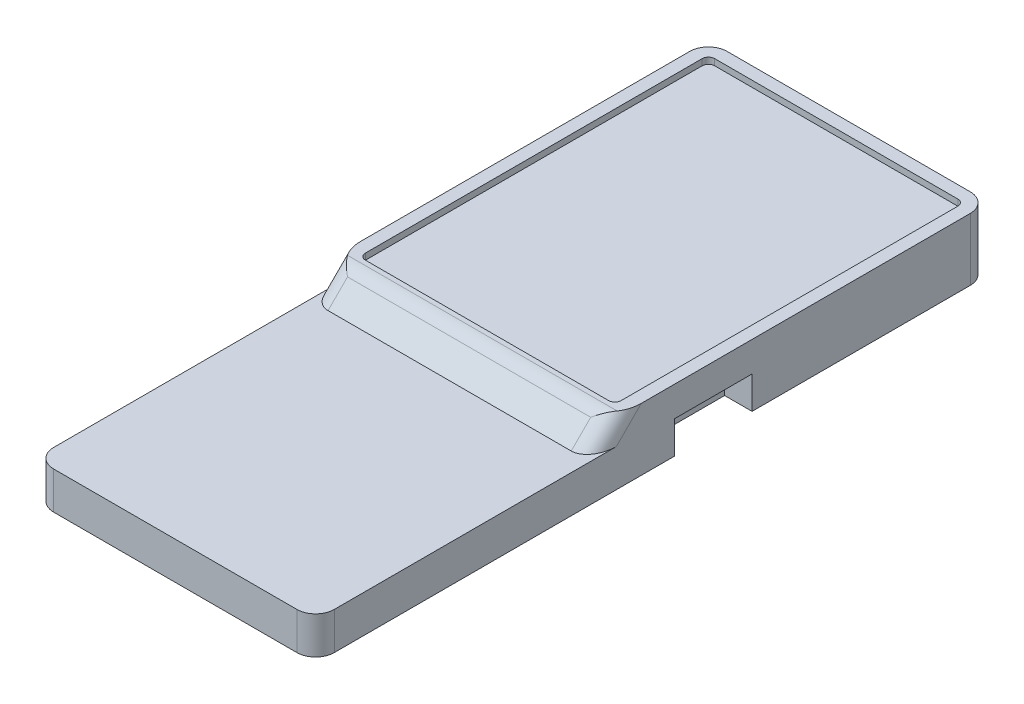
ISO-10303-21;
HEADER;
FILE_DESCRIPTION(('STEP AP214'),'2;1');
FILE_NAME('part.step','',(''),(''),'','','');
FILE_SCHEMA(('AUTOMOTIVE_DESIGN { 1 0 10303 214 1 1 1 1 }'));
ENDSEC;
DATA;
#1=APPLICATION_CONTEXT('core data for automotive mechanical design processes');
#2=APPLICATION_PROTOCOL_DEFINITION('international standard','automotive_design',2000,#1);
#3=PRODUCT_CONTEXT('',#1,'mechanical');
#4=PRODUCT('Part','Part','',(#3));
#5=PRODUCT_RELATED_PRODUCT_CATEGORY('part','',(#4));
#6=PRODUCT_DEFINITION_FORMATION('','',#4);
#7=PRODUCT_DEFINITION_CONTEXT('part definition',#1,'design');
#8=PRODUCT_DEFINITION('design','',#6,#7);
#9=PRODUCT_DEFINITION_SHAPE('','',#8);
#10=(LENGTH_UNIT() NAMED_UNIT(*) SI_UNIT(.MILLI.,.METRE.));
#11=(NAMED_UNIT(*) PLANE_ANGLE_UNIT() SI_UNIT($,.RADIAN.));
#12=(NAMED_UNIT(*) SI_UNIT($,.STERADIAN.) SOLID_ANGLE_UNIT());
#13=UNCERTAINTY_MEASURE_WITH_UNIT(LENGTH_MEASURE(1.E-05),#10,'distance_accuracy_value','');
#14=(GEOMETRIC_REPRESENTATION_CONTEXT(3) GLOBAL_UNCERTAINTY_ASSIGNED_CONTEXT((#13)) GLOBAL_UNIT_ASSIGNED_CONTEXT((#10,
#11,#12)) REPRESENTATION_CONTEXT('',''));
#15=CARTESIAN_POINT('',(0.,0.,0.));
#16=DIRECTION('',(0.,0.,1.));
#17=DIRECTION('',(1.,0.,0.));
#18=AXIS2_PLACEMENT_3D('',#15,#16,#17);
#19=CARTESIAN_POINT('',(-12.4,-4.5,0.));
#20=DIRECTION('',(-1.,0.,0.));
#21=DIRECTION('',(0.,0.,1.));
#22=AXIS2_PLACEMENT_3D('',#19,#20,#21);
#23=PLANE('',#22);
#24=DIRECTION('',(0.,0.,1.));
#25=VECTOR('',#24,1.);
#26=CARTESIAN_POINT('',(-12.4,-1.5,15.));
#27=LINE('',#26,#25);
#28=CARTESIAN_POINT('',(-12.4,-1.5,14.8786796564404));
#29=VERTEX_POINT('',#28);
#30=CARTESIAN_POINT('',(-12.4,-1.5,37.5));
#31=VERTEX_POINT('',#30);
#32=EDGE_CURVE('E386',#29,#31,#27,.T.);
#33=ORIENTED_EDGE('',*,*,#32,.F.);
#34=DIRECTION('',(0.,0.707106781186547,-0.707106781186549));
#35=VECTOR('',#34,1.);
#36=CARTESIAN_POINT('',(-12.4,4.43933982822018,8.93933982822016));
#37=LINE('',#36,#35);
#38=CARTESIAN_POINT('',(-12.4,0.5,12.8786796564404));
#39=VERTEX_POINT('',#38);
#40=EDGE_CURVE('E249',#29,#39,#37,.T.);
#41=ORIENTED_EDGE('',*,*,#40,.T.);
#42=DIRECTION('',(0.,0.,-1.));
#43=VECTOR('',#42,1.);
#44=CARTESIAN_POINT('',(-12.4,0.5,15.));
#45=LINE('',#44,#43);
#46=CARTESIAN_POINT('',(-12.4,0.5,-13.5));
#47=VERTEX_POINT('',#46);
#48=EDGE_CURVE('E468',#39,#47,#45,.T.);
#49=ORIENTED_EDGE('',*,*,#48,.T.);
#50=DIRECTION('',(0.,1.,0.));
#51=VECTOR('',#50,1.);
#52=CARTESIAN_POINT('',(-12.4,-4.5,-13.5));
#53=LINE('',#52,#51);
#54=CARTESIAN_POINT('',(-12.4,-4.5,-13.5));
#55=VERTEX_POINT('',#54);
#56=EDGE_CURVE('E428',#47,#55,#53,.F.);
#57=ORIENTED_EDGE('',*,*,#56,.T.);
#58=DIRECTION('',(0.,0.,1.));
#59=VECTOR('',#58,1.);
#60=CARTESIAN_POINT('',(-12.4,-4.5,0.));
#61=LINE('',#60,#59);
#62=CARTESIAN_POINT('',(-12.4,-4.5,4.));
#63=VERTEX_POINT('',#62);
#64=EDGE_CURVE('E399',#55,#63,#61,.T.);
#65=ORIENTED_EDGE('',*,*,#64,.T.);
#66=DIRECTION('',(0.,-1.,0.));
#67=VECTOR('',#66,1.);
#68=CARTESIAN_POINT('',(-12.4,-1.9,4.));
#69=LINE('',#68,#67);
#70=CARTESIAN_POINT('',(-12.4,-1.9,4.));
#71=VERTEX_POINT('',#70);
#72=EDGE_CURVE('E340',#71,#63,#69,.T.);
#73=ORIENTED_EDGE('',*,*,#72,.F.);
#74=DIRECTION('',(0.,0.,1.));
#75=VECTOR('',#74,1.);
#76=CARTESIAN_POINT('',(-12.4,-1.9,10.2));
#77=LINE('',#76,#75);
#78=CARTESIAN_POINT('',(-12.4,-1.9,10.2));
#79=VERTEX_POINT('',#78);
#80=EDGE_CURVE('E330',#71,#79,#77,.T.);
#81=ORIENTED_EDGE('',*,*,#80,.T.);
#82=DIRECTION('',(0.,-1.,0.));
#83=VECTOR('',#82,1.);
#84=CARTESIAN_POINT('',(-12.4,-1.9,10.2));
#85=LINE('',#84,#83);
#86=CARTESIAN_POINT('',(-12.4,-4.5,10.2));
#87=VERTEX_POINT('',#86);
#88=EDGE_CURVE('E348',#79,#87,#85,.T.);
#89=ORIENTED_EDGE('',*,*,#88,.T.);
#90=CARTESIAN_POINT('',(-12.4,-4.5,37.5));
#91=VERTEX_POINT('',#90);
#92=EDGE_CURVE('E398',#87,#91,#61,.T.);
#93=ORIENTED_EDGE('',*,*,#92,.T.);
#94=DIRECTION('',(0.,-1.,0.));
#95=VECTOR('',#94,1.);
#96=CARTESIAN_POINT('',(-12.4,-1.5,37.5));
#97=LINE('',#96,#95);
#98=EDGE_CURVE('E425',#91,#31,#97,.F.);
#99=ORIENTED_EDGE('',*,*,#98,.T.);
#100=EDGE_LOOP('',(#33,#41,#49,#57,#65,#73,#81,#89,#93,#99));
#101=FACE_BOUND('',#100,.T.);
#102=ADVANCED_FACE('F36',(#101),#23,.T.);
#103=CARTESIAN_POINT('',(0.,-4.5,0.));
#104=DIRECTION('',(0.,1.,0.));
#105=DIRECTION('',(0.,0.,1.));
#106=AXIS2_PLACEMENT_3D('',#103,#104,#105);
#107=PLANE('',#106);
#108=DIRECTION('',(1.,0.,0.));
#109=VECTOR('',#108,1.);
#110=CARTESIAN_POINT('',(-10.2,-4.5,10.2));
#111=LINE('',#110,#109);
#112=CARTESIAN_POINT('',(-10.2,-4.5,10.2));
#113=VERTEX_POINT('',#112);
#114=EDGE_CURVE('E334',#87,#113,#111,.T.);
#115=ORIENTED_EDGE('',*,*,#114,.T.);
#116=DIRECTION('',(0.,0.,-1.));
#117=VECTOR('',#116,1.);
#118=CARTESIAN_POINT('',(-10.2,-4.5,10.2));
#119=LINE('',#118,#117);
#120=CARTESIAN_POINT('',(-10.2,-4.5,4.));
#121=VERTEX_POINT('',#120);
#122=EDGE_CURVE('E343',#113,#121,#119,.T.);
#123=ORIENTED_EDGE('',*,*,#122,.T.);
#124=DIRECTION('',(-1.,0.,0.));
#125=VECTOR('',#124,1.);
#126=CARTESIAN_POINT('',(-10.2,-4.5,4.));
#127=LINE('',#126,#125);
#128=EDGE_CURVE('E329',#121,#63,#127,.T.);
#129=ORIENTED_EDGE('',*,*,#128,.T.);
#130=ORIENTED_EDGE('',*,*,#64,.F.);
#131=CARTESIAN_POINT('',(-10.9,-4.5,-13.5));
#132=DIRECTION('',(0.,1.,0.));
#133=DIRECTION('',(0.,0.,1.));
#134=AXIS2_PLACEMENT_3D('',#131,#132,#133);
#135=CIRCLE('',#134,1.5);
#136=CARTESIAN_POINT('',(-10.9,-4.5,-15.));
#137=VERTEX_POINT('',#136);
#138=EDGE_CURVE('E420',#55,#137,#135,.F.);
#139=ORIENTED_EDGE('',*,*,#138,.T.);
#140=DIRECTION('',(1.,0.,0.));
#141=VECTOR('',#140,1.);
#142=CARTESIAN_POINT('',(0.,-4.5,-15.));
#143=LINE('',#142,#141);
#144=CARTESIAN_POINT('',(8.6,-4.5,-15.));
#145=VERTEX_POINT('',#144);
#146=EDGE_CURVE('E393',#137,#145,#143,.T.);
#147=ORIENTED_EDGE('',*,*,#146,.T.);
#148=CARTESIAN_POINT('',(8.6,-4.5,-13.5));
#149=DIRECTION('',(0.,1.,0.));
#150=DIRECTION('',(0.,0.,1.));
#151=AXIS2_PLACEMENT_3D('',#148,#149,#150);
#152=CIRCLE('',#151,1.5);
#153=CARTESIAN_POINT('',(10.1,-4.5,-13.5));
#154=VERTEX_POINT('',#153);
#155=EDGE_CURVE('E422',#145,#154,#152,.F.);
#156=ORIENTED_EDGE('',*,*,#155,.T.);
#157=DIRECTION('',(0.,0.,-1.));
#158=VECTOR('',#157,1.);
#159=CARTESIAN_POINT('',(10.1,-4.5,0.));
#160=LINE('',#159,#158);
#161=CARTESIAN_POINT('',(10.1,-4.5,4.));
#162=VERTEX_POINT('',#161);
#163=EDGE_CURVE('E402',#162,#154,#160,.T.);
#164=ORIENTED_EDGE('',*,*,#163,.F.);
#165=DIRECTION('',(1.,0.,0.));
#166=VECTOR('',#165,1.);
#167=CARTESIAN_POINT('',(7.9,-4.5,4.));
#168=LINE('',#167,#166);
#169=CARTESIAN_POINT('',(7.9,-4.5,4.));
#170=VERTEX_POINT('',#169);
#171=EDGE_CURVE('E361',#170,#162,#168,.T.);
#172=ORIENTED_EDGE('',*,*,#171,.F.);
#173=DIRECTION('',(0.,0.,-1.));
#174=VECTOR('',#173,1.);
#175=CARTESIAN_POINT('',(7.9,-4.5,10.2));
#176=LINE('',#175,#174);
#177=CARTESIAN_POINT('',(7.9,-4.5,10.2));
#178=VERTEX_POINT('',#177);
#179=EDGE_CURVE('E373',#178,#170,#176,.T.);
#180=ORIENTED_EDGE('',*,*,#179,.F.);
#181=DIRECTION('',(-1.,0.,0.));
#182=VECTOR('',#181,1.);
#183=CARTESIAN_POINT('',(7.9,-4.5,10.2));
#184=LINE('',#183,#182);
#185=CARTESIAN_POINT('',(10.1,-4.5,10.2));
#186=VERTEX_POINT('',#185);
#187=EDGE_CURVE('E351',#186,#178,#184,.T.);
#188=ORIENTED_EDGE('',*,*,#187,.F.);
#189=CARTESIAN_POINT('',(10.1,-4.5,37.5));
#190=VERTEX_POINT('',#189);
#191=EDGE_CURVE('E403',#190,#186,#160,.T.);
#192=ORIENTED_EDGE('',*,*,#191,.F.);
#193=CARTESIAN_POINT('',(8.6,-4.5,37.5));
#194=DIRECTION('',(0.,1.,0.));
#195=DIRECTION('',(0.,0.,1.));
#196=AXIS2_PLACEMENT_3D('',#193,#194,#195);
#197=CIRCLE('',#196,1.5);
#198=CARTESIAN_POINT('',(8.6,-4.5,39.));
#199=VERTEX_POINT('',#198);
#200=EDGE_CURVE('E418',#190,#199,#197,.F.);
#201=ORIENTED_EDGE('',*,*,#200,.T.);
#202=DIRECTION('',(1.,0.,0.));
#203=VECTOR('',#202,1.);
#204=CARTESIAN_POINT('',(-12.4,-4.5,39.));
#205=LINE('',#204,#203);
#206=CARTESIAN_POINT('',(-10.9,-4.5,39.));
#207=VERTEX_POINT('',#206);
#208=EDGE_CURVE('E380',#207,#199,#205,.T.);
#209=ORIENTED_EDGE('',*,*,#208,.F.);
#210=CARTESIAN_POINT('',(-10.9,-4.5,37.5));
#211=DIRECTION('',(0.,1.,0.));
#212=DIRECTION('',(0.,0.,1.));
#213=AXIS2_PLACEMENT_3D('',#210,#211,#212);
#214=CIRCLE('',#213,1.5);
#215=EDGE_CURVE('E415',#207,#91,#214,.F.);
#216=ORIENTED_EDGE('',*,*,#215,.T.);
#217=ORIENTED_EDGE('',*,*,#92,.F.);
#218=EDGE_LOOP('',(#115,#123,#129,#130,#139,#147,#156,#164,#172,#180,#188,#192,#201,#209,#216,#217));
#219=FACE_BOUND('',#218,.T.);
#220=ADVANCED_FACE('F502',(#219),#107,.F.);
#221=CARTESIAN_POINT('',(0.,-4.5,-15.));
#222=DIRECTION('',(0.,0.,1.));
#223=DIRECTION('',(1.,0.,0.));
#224=AXIS2_PLACEMENT_3D('',#221,#222,#223);
#225=PLANE('',#224);
#226=DIRECTION('',(0.,1.,0.));
#227=VECTOR('',#226,1.);
#228=CARTESIAN_POINT('',(-10.9,0.,-15.));
#229=LINE('',#228,#227);
#230=CARTESIAN_POINT('',(-10.9,0.5,-15.));
#231=VERTEX_POINT('',#230);
#232=EDGE_CURVE('E411',#137,#231,#229,.T.);
#233=ORIENTED_EDGE('',*,*,#232,.T.);
#234=DIRECTION('',(1.,0.,0.));
#235=VECTOR('',#234,1.);
#236=CARTESIAN_POINT('',(8.6,0.5,-15.));
#237=LINE('',#236,#235);
#238=CARTESIAN_POINT('',(8.6,0.5,-15.));
#239=VERTEX_POINT('',#238);
#240=EDGE_CURVE('E459',#231,#239,#237,.T.);
#241=ORIENTED_EDGE('',*,*,#240,.T.);
#242=DIRECTION('',(0.,1.,0.));
#243=VECTOR('',#242,1.);
#244=CARTESIAN_POINT('',(8.6,-4.5,-15.));
#245=LINE('',#244,#243);
#246=EDGE_CURVE('E413',#239,#145,#245,.F.);
#247=ORIENTED_EDGE('',*,*,#246,.T.);
#248=ORIENTED_EDGE('',*,*,#146,.F.);
#249=EDGE_LOOP('',(#233,#241,#247,#248));
#250=FACE_BOUND('',#249,.T.);
#251=ADVANCED_FACE('F508',(#250),#225,.F.);
#252=CARTESIAN_POINT('',(10.1,-4.5,0.));
#253=DIRECTION('',(1.,0.,0.));
#254=DIRECTION('',(0.,0.,-1.));
#255=AXIS2_PLACEMENT_3D('',#252,#253,#254);
#256=PLANE('',#255);
#257=DIRECTION('',(0.,0.,1.));
#258=VECTOR('',#257,1.);
#259=CARTESIAN_POINT('',(10.1,0.5,15.));
#260=LINE('',#259,#258);
#261=CARTESIAN_POINT('',(10.1,0.5,-13.5));
#262=VERTEX_POINT('',#261);
#263=CARTESIAN_POINT('',(10.1,0.5,12.8786796564404));
#264=VERTEX_POINT('',#263);
#265=EDGE_CURVE('E453',#262,#264,#260,.T.);
#266=ORIENTED_EDGE('',*,*,#265,.T.);
#267=DIRECTION('',(0.,0.707106781186547,-0.707106781186549));
#268=VECTOR('',#267,1.);
#269=CARTESIAN_POINT('',(10.1,4.43933982822018,8.93933982822016));
#270=LINE('',#269,#268);
#271=CARTESIAN_POINT('',(10.1,-1.5,14.8786796564404));
#272=VERTEX_POINT('',#271);
#273=EDGE_CURVE('E247',#264,#272,#270,.F.);
#274=ORIENTED_EDGE('',*,*,#273,.T.);
#275=DIRECTION('',(0.,0.,-1.));
#276=VECTOR('',#275,1.);
#277=CARTESIAN_POINT('',(10.1,-1.5,15.));
#278=LINE('',#277,#276);
#279=CARTESIAN_POINT('',(10.1,-1.5,37.5));
#280=VERTEX_POINT('',#279);
#281=EDGE_CURVE('E391',#280,#272,#278,.T.);
#282=ORIENTED_EDGE('',*,*,#281,.F.);
#283=DIRECTION('',(0.,-1.,0.));
#284=VECTOR('',#283,1.);
#285=CARTESIAN_POINT('',(10.1,-4.5,37.5));
#286=LINE('',#285,#284);
#287=EDGE_CURVE('E406',#280,#190,#286,.T.);
#288=ORIENTED_EDGE('',*,*,#287,.T.);
#289=ORIENTED_EDGE('',*,*,#191,.T.);
#290=DIRECTION('',(0.,-1.,0.));
#291=VECTOR('',#290,1.);
#292=CARTESIAN_POINT('',(10.1,-1.9,10.2));
#293=LINE('',#292,#291);
#294=CARTESIAN_POINT('',(10.1,-1.9,10.2));
#295=VERTEX_POINT('',#294);
#296=EDGE_CURVE('E370',#295,#186,#293,.T.);
#297=ORIENTED_EDGE('',*,*,#296,.F.);
#298=DIRECTION('',(0.,0.,1.));
#299=VECTOR('',#298,1.);
#300=CARTESIAN_POINT('',(10.1,-1.9,10.2));
#301=LINE('',#300,#299);
#302=CARTESIAN_POINT('',(10.1,-1.9,4.));
#303=VERTEX_POINT('',#302);
#304=EDGE_CURVE('E357',#303,#295,#301,.T.);
#305=ORIENTED_EDGE('',*,*,#304,.F.);
#306=DIRECTION('',(0.,-1.,0.));
#307=VECTOR('',#306,1.);
#308=CARTESIAN_POINT('',(10.1,-1.9,4.));
#309=LINE('',#308,#307);
#310=EDGE_CURVE('E377',#303,#162,#309,.T.);
#311=ORIENTED_EDGE('',*,*,#310,.T.);
#312=ORIENTED_EDGE('',*,*,#163,.T.);
#313=DIRECTION('',(0.,1.,0.));
#314=VECTOR('',#313,1.);
#315=CARTESIAN_POINT('',(10.1,0.,-13.5));
#316=LINE('',#315,#314);
#317=EDGE_CURVE('E409',#154,#262,#316,.T.);
#318=ORIENTED_EDGE('',*,*,#317,.T.);
#319=EDGE_LOOP('',(#266,#274,#282,#288,#289,#297,#305,#311,#312,#318));
#320=FACE_BOUND('',#319,.T.);
#321=ADVANCED_FACE('F452',(#320),#256,.T.);
#322=CARTESIAN_POINT('',(0.,0.,0.));
#323=DIRECTION('',(0.,1.,0.));
#324=DIRECTION('',(0.,0.,1.));
#325=AXIS2_PLACEMENT_3D('',#322,#323,#324);
#326=PLANE('',#325);
#327=DIRECTION('',(0.,0.,-1.));
#328=VECTOR('',#327,1.);
#329=CARTESIAN_POINT('',(-11.4,0.,15.));
#330=LINE('',#329,#328);
#331=CARTESIAN_POINT('',(-11.4,0.,13.5));
#332=VERTEX_POINT('',#331);
#333=CARTESIAN_POINT('',(-11.4,0.,-13.5));
#334=VERTEX_POINT('',#333);
#335=EDGE_CURVE('E303',#332,#334,#330,.T.);
#336=ORIENTED_EDGE('',*,*,#335,.F.);
#337=CARTESIAN_POINT('',(-10.9,0.,13.5));
#338=DIRECTION('',(0.,1.,0.));
#339=DIRECTION('',(0.,0.,1.));
#340=AXIS2_PLACEMENT_3D('',#337,#338,#339);
#341=CIRCLE('',#340,0.5);
#342=CARTESIAN_POINT('',(-10.9,0.,14.));
#343=VERTEX_POINT('',#342);
#344=EDGE_CURVE('E267',#332,#343,#341,.T.);
#345=ORIENTED_EDGE('',*,*,#344,.T.);
#346=DIRECTION('',(-1.,0.,0.));
#347=VECTOR('',#346,1.);
#348=CARTESIAN_POINT('',(0.,0.,14.));
#349=LINE('',#348,#347);
#350=CARTESIAN_POINT('',(8.6,0.,14.));
#351=VERTEX_POINT('',#350);
#352=EDGE_CURVE('E289',#351,#343,#349,.T.);
#353=ORIENTED_EDGE('',*,*,#352,.F.);
#354=CARTESIAN_POINT('',(8.6,0.,13.5));
#355=DIRECTION('',(0.,1.,0.));
#356=DIRECTION('',(0.,0.,1.));
#357=AXIS2_PLACEMENT_3D('',#354,#355,#356);
#358=CIRCLE('',#357,0.5);
#359=CARTESIAN_POINT('',(9.1,0.,13.5));
#360=VERTEX_POINT('',#359);
#361=EDGE_CURVE('E265',#351,#360,#358,.T.);
#362=ORIENTED_EDGE('',*,*,#361,.T.);
#363=DIRECTION('',(0.,0.,-1.));
#364=VECTOR('',#363,1.);
#365=CARTESIAN_POINT('',(9.1,0.,15.));
#366=LINE('',#365,#364);
#367=CARTESIAN_POINT('',(9.1,0.,-13.5));
#368=VERTEX_POINT('',#367);
#369=EDGE_CURVE('E296',#368,#360,#366,.F.);
#370=ORIENTED_EDGE('',*,*,#369,.F.);
#371=CARTESIAN_POINT('',(8.6,0.,-13.5));
#372=DIRECTION('',(0.,1.,0.));
#373=DIRECTION('',(1.,0.,0.));
#374=AXIS2_PLACEMENT_3D('',#371,#372,#373);
#375=CIRCLE('',#374,0.500000000000001);
#376=CARTESIAN_POINT('',(8.6,0.,-14.));
#377=VERTEX_POINT('',#376);
#378=EDGE_CURVE('E317',#377,#368,#375,.F.);
#379=ORIENTED_EDGE('',*,*,#378,.F.);
#380=DIRECTION('',(1.,0.,0.));
#381=VECTOR('',#380,1.);
#382=CARTESIAN_POINT('',(8.6,0.,-14.));
#383=LINE('',#382,#381);
#384=CARTESIAN_POINT('',(-10.9,0.,-14.));
#385=VERTEX_POINT('',#384);
#386=EDGE_CURVE('E314',#385,#377,#383,.T.);
#387=ORIENTED_EDGE('',*,*,#386,.F.);
#388=CARTESIAN_POINT('',(-10.9,0.,-13.5));
#389=DIRECTION('',(0.,1.,0.));
#390=DIRECTION('',(1.,0.,0.));
#391=AXIS2_PLACEMENT_3D('',#388,#389,#390);
#392=CIRCLE('',#391,0.500000000000001);
#393=EDGE_CURVE('E305',#334,#385,#392,.F.);
#394=ORIENTED_EDGE('',*,*,#393,.F.);
#395=EDGE_LOOP('',(#336,#345,#353,#362,#370,#379,#387,#394));
#396=FACE_BOUND('',#395,.T.);
#397=ADVANCED_FACE('F295',(#396),#326,.T.);
#398=CARTESIAN_POINT('',(-12.4,-1.5,39.));
#399=DIRECTION('',(0.,0.,-1.));
#400=DIRECTION('',(-1.,0.,0.));
#401=AXIS2_PLACEMENT_3D('',#398,#399,#400);
#402=PLANE('',#401);
#403=ORIENTED_EDGE('',*,*,#208,.T.);
#404=DIRECTION('',(0.,-1.,0.));
#405=VECTOR('',#404,1.);
#406=CARTESIAN_POINT('',(8.6,-1.5,39.));
#407=LINE('',#406,#405);
#408=CARTESIAN_POINT('',(8.6,-1.5,39.));
#409=VERTEX_POINT('',#408);
#410=EDGE_CURVE('E433',#199,#409,#407,.F.);
#411=ORIENTED_EDGE('',*,*,#410,.T.);
#412=DIRECTION('',(1.,0.,0.));
#413=VECTOR('',#412,1.);
#414=CARTESIAN_POINT('',(-12.4,-1.5,39.));
#415=LINE('',#414,#413);
#416=CARTESIAN_POINT('',(-10.9,-1.5,39.));
#417=VERTEX_POINT('',#416);
#418=EDGE_CURVE('E388',#417,#409,#415,.T.);
#419=ORIENTED_EDGE('',*,*,#418,.F.);
#420=DIRECTION('',(0.,-1.,0.));
#421=VECTOR('',#420,1.);
#422=CARTESIAN_POINT('',(-10.9,-4.5,39.));
#423=LINE('',#422,#421);
#424=EDGE_CURVE('E430',#417,#207,#423,.T.);
#425=ORIENTED_EDGE('',*,*,#424,.T.);
#426=EDGE_LOOP('',(#403,#411,#419,#425));
#427=FACE_BOUND('',#426,.T.);
#428=ADVANCED_FACE('F590',(#427),#402,.F.);
#429=CARTESIAN_POINT('',(0.,-1.5,0.));
#430=DIRECTION('',(0.,1.,0.));
#431=DIRECTION('',(0.,0.,1.));
#432=AXIS2_PLACEMENT_3D('',#429,#430,#431);
#433=PLANE('',#432);
#434=ORIENTED_EDGE('',*,*,#32,.T.);
#435=CARTESIAN_POINT('',(-10.9,-1.5,37.5));
#436=DIRECTION('',(0.,1.,0.));
#437=DIRECTION('',(0.,0.,1.));
#438=AXIS2_PLACEMENT_3D('',#435,#436,#437);
#439=CIRCLE('',#438,1.5);
#440=EDGE_CURVE('E435',#31,#417,#439,.T.);
#441=ORIENTED_EDGE('',*,*,#440,.T.);
#442=ORIENTED_EDGE('',*,*,#418,.T.);
#443=CARTESIAN_POINT('',(8.6,-1.5,37.5));
#444=DIRECTION('',(0.,1.,0.));
#445=DIRECTION('',(0.,0.,1.));
#446=AXIS2_PLACEMENT_3D('',#443,#444,#445);
#447=CIRCLE('',#446,1.5);
#448=EDGE_CURVE('E437',#409,#280,#447,.T.);
#449=ORIENTED_EDGE('',*,*,#448,.T.);
#450=ORIENTED_EDGE('',*,*,#281,.T.);
#451=CARTESIAN_POINT('',(8.6,-1.5,14.8786796564404));
#452=DIRECTION('',(0.,1.,0.));
#453=DIRECTION('',(0.,0.,-1.));
#454=AXIS2_PLACEMENT_3D('',#451,#452,#453);
#455=ELLIPSE('',#454,2.12132034355965,1.5);
#456=CARTESIAN_POINT('',(8.6,-1.5,17.));
#457=VERTEX_POINT('',#456);
#458=EDGE_CURVE('E257',#272,#457,#455,.F.);
#459=ORIENTED_EDGE('',*,*,#458,.T.);
#460=DIRECTION('',(-1.,0.,0.));
#461=VECTOR('',#460,1.);
#462=CARTESIAN_POINT('',(13.705551275464,-1.5,17.));
#463=LINE('',#462,#461);
#464=CARTESIAN_POINT('',(-10.9,-1.5,17.));
#465=VERTEX_POINT('',#464);
#466=EDGE_CURVE('E232',#457,#465,#463,.T.);
#467=ORIENTED_EDGE('',*,*,#466,.T.);
#468=CARTESIAN_POINT('',(-10.9,-1.5,14.8786796564404));
#469=DIRECTION('',(0.,1.,0.));
#470=DIRECTION('',(0.,0.,-1.));
#471=AXIS2_PLACEMENT_3D('',#468,#469,#470);
#472=ELLIPSE('',#471,2.12132034355965,1.5);
#473=EDGE_CURVE('E259',#465,#29,#472,.F.);
#474=ORIENTED_EDGE('',*,*,#473,.T.);
#475=EDGE_LOOP('',(#434,#441,#442,#449,#450,#459,#467,#474));
#476=FACE_BOUND('',#475,.T.);
#477=ADVANCED_FACE('F446',(#476),#433,.T.);
#478=CARTESIAN_POINT('',(8.6,-4.5,-13.5));
#479=DIRECTION('',(0.,-1.,0.));
#480=DIRECTION('',(0.,0.,-1.));
#481=AXIS2_PLACEMENT_3D('',#478,#479,#480);
#482=CYLINDRICAL_SURFACE('',#481,1.5);
#483=ORIENTED_EDGE('',*,*,#155,.F.);
#484=ORIENTED_EDGE('',*,*,#246,.F.);
#485=CARTESIAN_POINT('',(8.6,0.5,-13.5));
#486=DIRECTION('',(0.,-1.,0.));
#487=DIRECTION('',(0.,0.,1.));
#488=AXIS2_PLACEMENT_3D('',#485,#486,#487);
#489=CIRCLE('',#488,1.5);
#490=EDGE_CURVE('E457',#239,#262,#489,.T.);
#491=ORIENTED_EDGE('',*,*,#490,.T.);
#492=ORIENTED_EDGE('',*,*,#317,.F.);
#493=EDGE_LOOP('',(#483,#484,#491,#492));
#494=FACE_BOUND('',#493,.T.);
#495=ADVANCED_FACE('F517',(#494),#482,.T.);
#496=CARTESIAN_POINT('',(-10.9,-4.5,-13.5));
#497=DIRECTION('',(0.,-1.,0.));
#498=DIRECTION('',(0.,0.,-1.));
#499=AXIS2_PLACEMENT_3D('',#496,#497,#498);
#500=CYLINDRICAL_SURFACE('',#499,1.5);
#501=ORIENTED_EDGE('',*,*,#138,.F.);
#502=ORIENTED_EDGE('',*,*,#56,.F.);
#503=CARTESIAN_POINT('',(-10.9,0.5,-13.5));
#504=DIRECTION('',(0.,-1.,0.));
#505=DIRECTION('',(0.,0.,-1.));
#506=AXIS2_PLACEMENT_3D('',#503,#504,#505);
#507=CIRCLE('',#506,1.5);
#508=EDGE_CURVE('E465',#47,#231,#507,.T.);
#509=ORIENTED_EDGE('',*,*,#508,.T.);
#510=ORIENTED_EDGE('',*,*,#232,.F.);
#511=EDGE_LOOP('',(#501,#502,#509,#510));
#512=FACE_BOUND('',#511,.T.);
#513=ADVANCED_FACE('F520',(#512),#500,.T.);
#514=CARTESIAN_POINT('',(8.6,-4.5,37.5));
#515=DIRECTION('',(0.,1.,0.));
#516=DIRECTION('',(0.,0.,1.));
#517=AXIS2_PLACEMENT_3D('',#514,#515,#516);
#518=CYLINDRICAL_SURFACE('',#517,1.5);
#519=ORIENTED_EDGE('',*,*,#448,.F.);
#520=ORIENTED_EDGE('',*,*,#410,.F.);
#521=ORIENTED_EDGE('',*,*,#200,.F.);
#522=ORIENTED_EDGE('',*,*,#287,.F.);
#523=EDGE_LOOP('',(#519,#520,#521,#522));
#524=FACE_BOUND('',#523,.T.);
#525=ADVANCED_FACE('F524',(#524),#518,.T.);
#526=CARTESIAN_POINT('',(-10.9,-1.5,37.5));
#527=DIRECTION('',(0.,1.,0.));
#528=DIRECTION('',(0.,0.,1.));
#529=AXIS2_PLACEMENT_3D('',#526,#527,#528);
#530=CYLINDRICAL_SURFACE('',#529,1.5);
#531=ORIENTED_EDGE('',*,*,#440,.F.);
#532=ORIENTED_EDGE('',*,*,#98,.F.);
#533=ORIENTED_EDGE('',*,*,#215,.F.);
#534=ORIENTED_EDGE('',*,*,#424,.F.);
#535=EDGE_LOOP('',(#531,#532,#533,#534));
#536=FACE_BOUND('',#535,.T.);
#537=ADVANCED_FACE('F528',(#536),#530,.T.);
#538=CARTESIAN_POINT('',(7.9,-1.9,4.));
#539=DIRECTION('',(0.,0.,-1.));
#540=DIRECTION('',(-1.,0.,0.));
#541=AXIS2_PLACEMENT_3D('',#538,#539,#540);
#542=PLANE('',#541);
#543=ORIENTED_EDGE('',*,*,#171,.T.);
#544=ORIENTED_EDGE('',*,*,#310,.F.);
#545=DIRECTION('',(1.,0.,0.));
#546=VECTOR('',#545,1.);
#547=CARTESIAN_POINT('',(7.9,-1.9,4.));
#548=LINE('',#547,#546);
#549=CARTESIAN_POINT('',(7.9,-1.9,4.));
#550=VERTEX_POINT('',#549);
#551=EDGE_CURVE('E367',#550,#303,#548,.T.);
#552=ORIENTED_EDGE('',*,*,#551,.F.);
#553=DIRECTION('',(0.,-1.,0.));
#554=VECTOR('',#553,1.);
#555=CARTESIAN_POINT('',(7.9,-1.9,4.));
#556=LINE('',#555,#554);
#557=EDGE_CURVE('E381',#550,#170,#556,.T.);
#558=ORIENTED_EDGE('',*,*,#557,.T.);
#559=EDGE_LOOP('',(#543,#544,#552,#558));
#560=FACE_BOUND('',#559,.T.);
#561=ADVANCED_FACE('F532',(#560),#542,.F.);
#562=CARTESIAN_POINT('',(7.9,-1.9,10.2));
#563=DIRECTION('',(-1.,0.,0.));
#564=DIRECTION('',(0.,0.,1.));
#565=AXIS2_PLACEMENT_3D('',#562,#563,#564);
#566=PLANE('',#565);
#567=ORIENTED_EDGE('',*,*,#179,.T.);
#568=ORIENTED_EDGE('',*,*,#557,.F.);
#569=DIRECTION('',(0.,0.,-1.));
#570=VECTOR('',#569,1.);
#571=CARTESIAN_POINT('',(7.9,-1.9,10.2));
#572=LINE('',#571,#570);
#573=CARTESIAN_POINT('',(7.9,-1.9,10.2));
#574=VERTEX_POINT('',#573);
#575=EDGE_CURVE('E364',#574,#550,#572,.T.);
#576=ORIENTED_EDGE('',*,*,#575,.F.);
#577=DIRECTION('',(0.,-1.,0.));
#578=VECTOR('',#577,1.);
#579=CARTESIAN_POINT('',(7.9,-1.9,10.2));
#580=LINE('',#579,#578);
#581=EDGE_CURVE('E383',#574,#178,#580,.T.);
#582=ORIENTED_EDGE('',*,*,#581,.T.);
#583=EDGE_LOOP('',(#567,#568,#576,#582));
#584=FACE_BOUND('',#583,.T.);
#585=ADVANCED_FACE('F580',(#584),#566,.F.);
#586=CARTESIAN_POINT('',(7.9,-1.9,10.2));
#587=DIRECTION('',(0.,0.,1.));
#588=DIRECTION('',(1.,0.,0.));
#589=AXIS2_PLACEMENT_3D('',#586,#587,#588);
#590=PLANE('',#589);
#591=ORIENTED_EDGE('',*,*,#187,.T.);
#592=ORIENTED_EDGE('',*,*,#581,.F.);
#593=DIRECTION('',(-1.,0.,0.));
#594=VECTOR('',#593,1.);
#595=CARTESIAN_POINT('',(7.9,-1.9,10.2));
#596=LINE('',#595,#594);
#597=EDGE_CURVE('E360',#295,#574,#596,.T.);
#598=ORIENTED_EDGE('',*,*,#597,.F.);
#599=ORIENTED_EDGE('',*,*,#296,.T.);
#600=EDGE_LOOP('',(#591,#592,#598,#599));
#601=FACE_BOUND('',#600,.T.);
#602=ADVANCED_FACE('F576',(#601),#590,.F.);
#603=CARTESIAN_POINT('',(0.,-1.9,0.));
#604=DIRECTION('',(0.,-1.,0.));
#605=DIRECTION('',(0.,0.,-1.));
#606=AXIS2_PLACEMENT_3D('',#603,#604,#605);
#607=PLANE('',#606);
#608=ORIENTED_EDGE('',*,*,#304,.T.);
#609=ORIENTED_EDGE('',*,*,#597,.T.);
#610=ORIENTED_EDGE('',*,*,#575,.T.);
#611=ORIENTED_EDGE('',*,*,#551,.T.);
#612=EDGE_LOOP('',(#608,#609,#610,#611));
#613=FACE_BOUND('',#612,.T.);
#614=ADVANCED_FACE('F566',(#613),#607,.T.);
#615=CARTESIAN_POINT('',(-10.2,-1.9,10.2));
#616=DIRECTION('',(0.,0.,-1.));
#617=DIRECTION('',(-1.,0.,0.));
#618=AXIS2_PLACEMENT_3D('',#615,#616,#617);
#619=PLANE('',#618);
#620=ORIENTED_EDGE('',*,*,#114,.F.);
#621=ORIENTED_EDGE('',*,*,#88,.F.);
#622=DIRECTION('',(1.,0.,0.));
#623=VECTOR('',#622,1.);
#624=CARTESIAN_POINT('',(-10.2,-1.9,10.2));
#625=LINE('',#624,#623);
#626=CARTESIAN_POINT('',(-10.2,-1.9,10.2));
#627=VERTEX_POINT('',#626);
#628=EDGE_CURVE('E338',#79,#627,#625,.T.);
#629=ORIENTED_EDGE('',*,*,#628,.T.);
#630=DIRECTION('',(0.,-1.,0.));
#631=VECTOR('',#630,1.);
#632=CARTESIAN_POINT('',(-10.2,-1.9,10.2));
#633=LINE('',#632,#631);
#634=EDGE_CURVE('E352',#627,#113,#633,.T.);
#635=ORIENTED_EDGE('',*,*,#634,.T.);
#636=EDGE_LOOP('',(#620,#621,#629,#635));
#637=FACE_BOUND('',#636,.T.);
#638=ADVANCED_FACE('F562',(#637),#619,.T.);
#639=CARTESIAN_POINT('',(-10.2,-1.9,10.2));
#640=DIRECTION('',(-1.,0.,0.));
#641=DIRECTION('',(0.,0.,1.));
#642=AXIS2_PLACEMENT_3D('',#639,#640,#641);
#643=PLANE('',#642);
#644=ORIENTED_EDGE('',*,*,#122,.F.);
#645=ORIENTED_EDGE('',*,*,#634,.F.);
#646=DIRECTION('',(0.,0.,-1.));
#647=VECTOR('',#646,1.);
#648=CARTESIAN_POINT('',(-10.2,-1.9,10.2));
#649=LINE('',#648,#647);
#650=CARTESIAN_POINT('',(-10.2,-1.9,4.));
#651=VERTEX_POINT('',#650);
#652=EDGE_CURVE('E336',#627,#651,#649,.T.);
#653=ORIENTED_EDGE('',*,*,#652,.T.);
#654=DIRECTION('',(0.,-1.,0.));
#655=VECTOR('',#654,1.);
#656=CARTESIAN_POINT('',(-10.2,-1.9,4.));
#657=LINE('',#656,#655);
#658=EDGE_CURVE('E354',#651,#121,#657,.T.);
#659=ORIENTED_EDGE('',*,*,#658,.T.);
#660=EDGE_LOOP('',(#644,#645,#653,#659));
#661=FACE_BOUND('',#660,.T.);
#662=ADVANCED_FACE('F565',(#661),#643,.T.);
#663=CARTESIAN_POINT('',(-10.2,-1.9,4.));
#664=DIRECTION('',(0.,0.,1.));
#665=DIRECTION('',(1.,0.,0.));
#666=AXIS2_PLACEMENT_3D('',#663,#664,#665);
#667=PLANE('',#666);
#668=ORIENTED_EDGE('',*,*,#128,.F.);
#669=ORIENTED_EDGE('',*,*,#658,.F.);
#670=DIRECTION('',(-1.,0.,0.));
#671=VECTOR('',#670,1.);
#672=CARTESIAN_POINT('',(-10.2,-1.9,4.));
#673=LINE('',#672,#671);
#674=EDGE_CURVE('E333',#651,#71,#673,.T.);
#675=ORIENTED_EDGE('',*,*,#674,.T.);
#676=ORIENTED_EDGE('',*,*,#72,.T.);
#677=EDGE_LOOP('',(#668,#669,#675,#676));
#678=FACE_BOUND('',#677,.T.);
#679=ADVANCED_FACE('F560',(#678),#667,.T.);
#680=CARTESIAN_POINT('',(-2.29999999999999,-1.9,0.));
#681=DIRECTION('',(0.,-1.,0.));
#682=DIRECTION('',(0.,0.,-1.));
#683=AXIS2_PLACEMENT_3D('',#680,#681,#682);
#684=PLANE('',#683);
#685=ORIENTED_EDGE('',*,*,#80,.F.);
#686=ORIENTED_EDGE('',*,*,#674,.F.);
#687=ORIENTED_EDGE('',*,*,#652,.F.);
#688=ORIENTED_EDGE('',*,*,#628,.F.);
#689=EDGE_LOOP('',(#685,#686,#687,#688));
#690=FACE_BOUND('',#689,.T.);
#691=ADVANCED_FACE('F557',(#690),#684,.T.);
#692=CARTESIAN_POINT('',(9.1,0.5,15.));
#693=DIRECTION('',(1.,0.,0.));
#694=DIRECTION('',(0.,0.,-1.));
#695=AXIS2_PLACEMENT_3D('',#692,#693,#694);
#696=PLANE('',#695);
#697=ORIENTED_EDGE('',*,*,#369,.T.);
#698=DIRECTION('',(0.,1.,0.));
#699=VECTOR('',#698,1.);
#700=CARTESIAN_POINT('',(9.1,0.5,13.5));
#701=LINE('',#700,#699);
#702=CARTESIAN_POINT('',(9.1,0.5,13.5));
#703=VERTEX_POINT('',#702);
#704=EDGE_CURVE('E273',#360,#703,#701,.T.);
#705=ORIENTED_EDGE('',*,*,#704,.T.);
#706=DIRECTION('',(0.,0.,-1.));
#707=VECTOR('',#706,1.);
#708=CARTESIAN_POINT('',(9.1,0.5,15.));
#709=LINE('',#708,#707);
#710=CARTESIAN_POINT('',(9.1,0.5,-13.5));
#711=VERTEX_POINT('',#710);
#712=EDGE_CURVE('E58',#711,#703,#709,.F.);
#713=ORIENTED_EDGE('',*,*,#712,.F.);
#714=DIRECTION('',(0.,-1.,0.));
#715=VECTOR('',#714,1.);
#716=CARTESIAN_POINT('',(9.1,0.5,-13.5));
#717=LINE('',#716,#715);
#718=EDGE_CURVE('E302',#711,#368,#717,.T.);
#719=ORIENTED_EDGE('',*,*,#718,.T.);
#720=EDGE_LOOP('',(#697,#705,#713,#719));
#721=FACE_BOUND('',#720,.T.);
#722=ADVANCED_FACE('F300',(#721),#696,.F.);
#723=CARTESIAN_POINT('',(-11.4,0.5,15.));
#724=DIRECTION('',(-1.,0.,0.));
#725=DIRECTION('',(0.,0.,1.));
#726=AXIS2_PLACEMENT_3D('',#723,#724,#725);
#727=PLANE('',#726);
#728=DIRECTION('',(0.,0.,-1.));
#729=VECTOR('',#728,1.);
#730=CARTESIAN_POINT('',(-11.4,0.5,15.));
#731=LINE('',#730,#729);
#732=CARTESIAN_POINT('',(-11.4,0.5,13.5));
#733=VERTEX_POINT('',#732);
#734=CARTESIAN_POINT('',(-11.4,0.5,-13.5));
#735=VERTEX_POINT('',#734);
#736=EDGE_CURVE('E470',#733,#735,#731,.T.);
#737=ORIENTED_EDGE('',*,*,#736,.F.);
#738=DIRECTION('',(0.,-1.,0.));
#739=VECTOR('',#738,1.);
#740=CARTESIAN_POINT('',(-11.4,0.5,13.5));
#741=LINE('',#740,#739);
#742=EDGE_CURVE('E262',#733,#332,#741,.T.);
#743=ORIENTED_EDGE('',*,*,#742,.T.);
#744=ORIENTED_EDGE('',*,*,#335,.T.);
#745=DIRECTION('',(0.,-1.,0.));
#746=VECTOR('',#745,1.);
#747=CARTESIAN_POINT('',(-11.4,0.5,-13.5));
#748=LINE('',#747,#746);
#749=EDGE_CURVE('E326',#735,#334,#748,.T.);
#750=ORIENTED_EDGE('',*,*,#749,.F.);
#751=EDGE_LOOP('',(#737,#743,#744,#750));
#752=FACE_BOUND('',#751,.T.);
#753=ADVANCED_FACE('F489',(#752),#727,.F.);
#754=CARTESIAN_POINT('',(-10.9,0.5,-13.5));
#755=DIRECTION('',(0.,-1.,0.));
#756=DIRECTION('',(0.,0.,-1.));
#757=AXIS2_PLACEMENT_3D('',#754,#755,#756);
#758=CYLINDRICAL_SURFACE('',#757,0.500000000000001);
#759=ORIENTED_EDGE('',*,*,#393,.T.);
#760=DIRECTION('',(0.,-1.,0.));
#761=VECTOR('',#760,1.);
#762=CARTESIAN_POINT('',(-10.9,0.5,-14.));
#763=LINE('',#762,#761);
#764=CARTESIAN_POINT('',(-10.9,0.5,-14.));
#765=VERTEX_POINT('',#764);
#766=EDGE_CURVE('E323',#765,#385,#763,.T.);
#767=ORIENTED_EDGE('',*,*,#766,.F.);
#768=CARTESIAN_POINT('',(-10.9,0.5,-13.5));
#769=DIRECTION('',(0.,1.,0.));
#770=DIRECTION('',(1.,0.,0.));
#771=AXIS2_PLACEMENT_3D('',#768,#769,#770);
#772=CIRCLE('',#771,0.500000000000001);
#773=EDGE_CURVE('E472',#735,#765,#772,.F.);
#774=ORIENTED_EDGE('',*,*,#773,.F.);
#775=ORIENTED_EDGE('',*,*,#749,.T.);
#776=EDGE_LOOP('',(#759,#767,#774,#775));
#777=FACE_BOUND('',#776,.T.);
#778=ADVANCED_FACE('F485',(#777),#758,.F.);
#779=CARTESIAN_POINT('',(8.6,0.5,-14.));
#780=DIRECTION('',(0.,0.,-1.));
#781=DIRECTION('',(-1.,0.,0.));
#782=AXIS2_PLACEMENT_3D('',#779,#780,#781);
#783=PLANE('',#782);
#784=ORIENTED_EDGE('',*,*,#386,.T.);
#785=DIRECTION('',(0.,-1.,0.));
#786=VECTOR('',#785,1.);
#787=CARTESIAN_POINT('',(8.6,0.5,-14.));
#788=LINE('',#787,#786);
#789=CARTESIAN_POINT('',(8.6,0.5,-14.));
#790=VERTEX_POINT('',#789);
#791=EDGE_CURVE('E320',#790,#377,#788,.T.);
#792=ORIENTED_EDGE('',*,*,#791,.F.);
#793=DIRECTION('',(1.,0.,0.));
#794=VECTOR('',#793,1.);
#795=CARTESIAN_POINT('',(8.6,0.5,-14.));
#796=LINE('',#795,#794);
#797=EDGE_CURVE('E473',#765,#790,#796,.T.);
#798=ORIENTED_EDGE('',*,*,#797,.F.);
#799=ORIENTED_EDGE('',*,*,#766,.T.);
#800=EDGE_LOOP('',(#784,#792,#798,#799));
#801=FACE_BOUND('',#800,.T.);
#802=ADVANCED_FACE('F481',(#801),#783,.F.);
#803=CARTESIAN_POINT('',(8.6,0.5,-13.5));
#804=DIRECTION('',(0.,-1.,0.));
#805=DIRECTION('',(0.,0.,-1.));
#806=AXIS2_PLACEMENT_3D('',#803,#804,#805);
#807=CYLINDRICAL_SURFACE('',#806,0.500000000000001);
#808=ORIENTED_EDGE('',*,*,#378,.T.);
#809=ORIENTED_EDGE('',*,*,#718,.F.);
#810=CARTESIAN_POINT('',(8.6,0.5,-13.5));
#811=DIRECTION('',(0.,1.,0.));
#812=DIRECTION('',(1.,0.,0.));
#813=AXIS2_PLACEMENT_3D('',#810,#811,#812);
#814=CIRCLE('',#813,0.500000000000001);
#815=EDGE_CURVE('E309',#790,#711,#814,.F.);
#816=ORIENTED_EDGE('',*,*,#815,.F.);
#817=ORIENTED_EDGE('',*,*,#791,.T.);
#818=EDGE_LOOP('',(#808,#809,#816,#817));
#819=FACE_BOUND('',#818,.T.);
#820=ADVANCED_FACE('F478',(#819),#807,.F.);
#821=CARTESIAN_POINT('',(8.6,0.5,-13.5));
#822=DIRECTION('',(0.,-1.,0.));
#823=DIRECTION('',(-1.,0.,0.));
#824=AXIS2_PLACEMENT_3D('',#821,#822,#823);
#825=PLANE('',#824);
#826=ORIENTED_EDGE('',*,*,#736,.T.);
#827=ORIENTED_EDGE('',*,*,#773,.T.);
#828=ORIENTED_EDGE('',*,*,#797,.T.);
#829=ORIENTED_EDGE('',*,*,#815,.T.);
#830=ORIENTED_EDGE('',*,*,#712,.T.);
#831=CARTESIAN_POINT('',(8.6,0.5,13.5));
#832=DIRECTION('',(0.,-1.,0.));
#833=DIRECTION('',(0.,0.,-1.));
#834=AXIS2_PLACEMENT_3D('',#831,#832,#833);
#835=CIRCLE('',#834,0.5);
#836=CARTESIAN_POINT('',(8.6,0.5,14.));
#837=VERTEX_POINT('',#836);
#838=EDGE_CURVE('E44',#703,#837,#835,.T.);
#839=ORIENTED_EDGE('',*,*,#838,.T.);
#840=DIRECTION('',(-1.,0.,0.));
#841=VECTOR('',#840,1.);
#842=CARTESIAN_POINT('',(13.705551275464,0.5,14.));
#843=LINE('',#842,#841);
#844=CARTESIAN_POINT('',(-10.9,0.5,14.));
#845=VERTEX_POINT('',#844);
#846=EDGE_CURVE('E279',#837,#845,#843,.T.);
#847=ORIENTED_EDGE('',*,*,#846,.T.);
#848=CARTESIAN_POINT('',(-10.9,0.5,13.5));
#849=DIRECTION('',(0.,-1.,0.));
#850=DIRECTION('',(0.,0.,-1.));
#851=AXIS2_PLACEMENT_3D('',#848,#849,#850);
#852=CIRCLE('',#851,0.5);
#853=EDGE_CURVE('E276',#845,#733,#852,.T.);
#854=ORIENTED_EDGE('',*,*,#853,.T.);
#855=EDGE_LOOP('',(#826,#827,#828,#829,#830,#839,#847,#854));
#856=FACE_BOUND('',#855,.T.);
#857=ORIENTED_EDGE('',*,*,#48,.F.);
#858=CARTESIAN_POINT('',(-10.9,0.5,12.8786796564404));
#859=DIRECTION('',(0.,-1.,0.));
#860=DIRECTION('',(0.,0.,-1.));
#861=AXIS2_PLACEMENT_3D('',#858,#859,#860);
#862=ELLIPSE('',#861,2.12132034355965,1.5);
#863=CARTESIAN_POINT('',(-11.9606601717798,0.5,14.3786796564404));
#864=VERTEX_POINT('',#863);
#865=EDGE_CURVE('E241',#39,#864,#862,.F.);
#866=ORIENTED_EDGE('',*,*,#865,.T.);
#867=DIRECTION('',(-1.,0.,0.));
#868=VECTOR('',#867,1.);
#869=CARTESIAN_POINT('',(10.1,0.5,14.3786796564404));
#870=LINE('',#869,#868);
#871=CARTESIAN_POINT('',(9.66066017177982,0.5,14.3786796564404));
#872=VERTEX_POINT('',#871);
#873=EDGE_CURVE('E50',#872,#864,#870,.T.);
#874=ORIENTED_EDGE('',*,*,#873,.F.);
#875=CARTESIAN_POINT('',(8.6,0.5,12.8786796564404));
#876=DIRECTION('',(0.,-1.,0.));
#877=DIRECTION('',(0.,0.,-1.));
#878=AXIS2_PLACEMENT_3D('',#875,#876,#877);
#879=ELLIPSE('',#878,2.12132034355965,1.5);
#880=EDGE_CURVE('E239',#872,#264,#879,.F.);
#881=ORIENTED_EDGE('',*,*,#880,.T.);
#882=ORIENTED_EDGE('',*,*,#265,.F.);
#883=ORIENTED_EDGE('',*,*,#490,.F.);
#884=ORIENTED_EDGE('',*,*,#240,.F.);
#885=ORIENTED_EDGE('',*,*,#508,.F.);
#886=EDGE_LOOP('',(#857,#866,#874,#881,#882,#883,#884,#885));
#887=FACE_BOUND('',#886,.T.);
#888=ADVANCED_FACE('F237',(#856,#887),#825,.F.);
#889=CARTESIAN_POINT('',(13.705551275464,-1.5,14.));
#890=DIRECTION('',(0.,0.,-1.));
#891=DIRECTION('',(-1.,0.,0.));
#892=AXIS2_PLACEMENT_3D('',#889,#890,#891);
#893=PLANE('',#892);
#894=ORIENTED_EDGE('',*,*,#352,.T.);
#895=DIRECTION('',(0.,-1.,0.));
#896=VECTOR('',#895,1.);
#897=CARTESIAN_POINT('',(-10.9,-1.5,14.));
#898=LINE('',#897,#896);
#899=EDGE_CURVE('E271',#343,#845,#898,.F.);
#900=ORIENTED_EDGE('',*,*,#899,.T.);
#901=ORIENTED_EDGE('',*,*,#846,.F.);
#902=DIRECTION('',(0.,1.,0.));
#903=VECTOR('',#902,1.);
#904=CARTESIAN_POINT('',(8.6,-1.5,14.));
#905=LINE('',#904,#903);
#906=EDGE_CURVE('E269',#837,#351,#905,.F.);
#907=ORIENTED_EDGE('',*,*,#906,.T.);
#908=EDGE_LOOP('',(#894,#900,#901,#907));
#909=FACE_BOUND('',#908,.T.);
#910=ADVANCED_FACE('F286',(#909),#893,.T.);
#911=CARTESIAN_POINT('',(13.705551275464,0.5,15.));
#912=DIRECTION('',(0.,0.707106781186548,0.707106781186546));
#913=DIRECTION('',(0.,-0.707106781186547,0.707106781186549));
#914=AXIS2_PLACEMENT_3D('',#911,#912,#913);
#915=PLANE('',#914);
#916=DIRECTION('',(-1.,0.,0.));
#917=VECTOR('',#916,1.);
#918=CARTESIAN_POINT('',(10.1,0.0606601717798218,15.4393398282202));
#919=LINE('',#918,#917);
#920=CARTESIAN_POINT('',(8.60000000000001,0.0606601717798218,15.4393398282202));
#921=VERTEX_POINT('',#920);
#922=CARTESIAN_POINT('',(-10.9,0.0606601717798218,15.4393398282202));
#923=VERTEX_POINT('',#922);
#924=EDGE_CURVE('E227',#921,#923,#919,.T.);
#925=ORIENTED_EDGE('',*,*,#924,.T.);
#926=DIRECTION('',(0.,0.707106781186547,-0.707106781186549));
#927=VECTOR('',#926,1.);
#928=CARTESIAN_POINT('',(-10.9,0.5,15.));
#929=LINE('',#928,#927);
#930=EDGE_CURVE('E439',#923,#465,#929,.F.);
#931=ORIENTED_EDGE('',*,*,#930,.T.);
#932=ORIENTED_EDGE('',*,*,#466,.F.);
#933=DIRECTION('',(0.,0.707106781186547,-0.707106781186549));
#934=VECTOR('',#933,1.);
#935=CARTESIAN_POINT('',(8.6,0.5,15.));
#936=LINE('',#935,#934);
#937=EDGE_CURVE('E251',#457,#921,#936,.T.);
#938=ORIENTED_EDGE('',*,*,#937,.T.);
#939=EDGE_LOOP('',(#925,#931,#932,#938));
#940=FACE_BOUND('',#939,.T.);
#941=ADVANCED_FACE('F442',(#940),#915,.T.);
#942=CARTESIAN_POINT('',(8.6,-0.560660171779823,13.9393398282202));
#943=DIRECTION('',(0.,0.707106781186547,-0.707106781186549));
#944=DIRECTION('',(0.,0.707106781186549,0.707106781186547));
#945=AXIS2_PLACEMENT_3D('',#942,#943,#944);
#946=CYLINDRICAL_SURFACE('',#945,1.5);
#947=CARTESIAN_POINT('',(8.6,-1.,14.3786796564404));
#948=DIRECTION('',(-0.707106781186547,0.499999999999999,-0.500000000000001));
#949=DIRECTION('',(0.707106781186547,0.499999999999999,-0.500000000000001));
#950=AXIS2_PLACEMENT_3D('',#947,#948,#949);
#951=ELLIPSE('',#950,2.12132034355964,1.5);
#952=EDGE_CURVE('E224',#921,#872,#951,.T.);
#953=ORIENTED_EDGE('',*,*,#952,.F.);
#954=ORIENTED_EDGE('',*,*,#937,.F.);
#955=ORIENTED_EDGE('',*,*,#458,.F.);
#956=ORIENTED_EDGE('',*,*,#273,.F.);
#957=ORIENTED_EDGE('',*,*,#880,.F.);
#958=EDGE_LOOP('',(#953,#954,#955,#956,#957));
#959=FACE_BOUND('',#958,.T.);
#960=ADVANCED_FACE('F244',(#959),#946,.T.);
#961=CARTESIAN_POINT('',(-10.9,4.43933982822018,8.93933982822016));
#962=DIRECTION('',(0.,0.707106781186547,-0.707106781186549));
#963=DIRECTION('',(0.,0.707106781186549,0.707106781186547));
#964=AXIS2_PLACEMENT_3D('',#961,#962,#963);
#965=CYLINDRICAL_SURFACE('',#964,1.5);
#966=CARTESIAN_POINT('',(-10.9,-1.,14.3786796564404));
#967=DIRECTION('',(0.707106781186547,0.499999999999999,-0.500000000000001));
#968=DIRECTION('',(-0.707106781186547,0.499999999999999,-0.500000000000001));
#969=AXIS2_PLACEMENT_3D('',#966,#967,#968);
#970=ELLIPSE('',#969,2.12132034355964,1.5);
#971=EDGE_CURVE('E11',#864,#923,#970,.T.);
#972=ORIENTED_EDGE('',*,*,#971,.F.);
#973=ORIENTED_EDGE('',*,*,#865,.F.);
#974=ORIENTED_EDGE('',*,*,#40,.F.);
#975=ORIENTED_EDGE('',*,*,#473,.F.);
#976=ORIENTED_EDGE('',*,*,#930,.F.);
#977=EDGE_LOOP('',(#972,#973,#974,#975,#976));
#978=FACE_BOUND('',#977,.T.);
#979=ADVANCED_FACE('F494',(#978),#965,.T.);
#980=CARTESIAN_POINT('',(-10.9,0.5,13.5));
#981=DIRECTION('',(0.,-1.,0.));
#982=DIRECTION('',(0.,0.,-1.));
#983=AXIS2_PLACEMENT_3D('',#980,#981,#982);
#984=CYLINDRICAL_SURFACE('',#983,0.5);
#985=ORIENTED_EDGE('',*,*,#853,.F.);
#986=ORIENTED_EDGE('',*,*,#899,.F.);
#987=ORIENTED_EDGE('',*,*,#344,.F.);
#988=ORIENTED_EDGE('',*,*,#742,.F.);
#989=EDGE_LOOP('',(#985,#986,#987,#988));
#990=FACE_BOUND('',#989,.T.);
#991=ADVANCED_FACE('F492',(#990),#984,.F.);
#992=CARTESIAN_POINT('',(8.6,0.5,13.5));
#993=DIRECTION('',(0.,1.,0.));
#994=DIRECTION('',(0.,0.,1.));
#995=AXIS2_PLACEMENT_3D('',#992,#993,#994);
#996=CYLINDRICAL_SURFACE('',#995,0.5);
#997=ORIENTED_EDGE('',*,*,#361,.F.);
#998=ORIENTED_EDGE('',*,*,#906,.F.);
#999=ORIENTED_EDGE('',*,*,#838,.F.);
#1000=ORIENTED_EDGE('',*,*,#704,.F.);
#1001=EDGE_LOOP('',(#997,#998,#999,#1000));
#1002=FACE_BOUND('',#1001,.T.);
#1003=ADVANCED_FACE('F38',(#1002),#996,.F.);
#1004=CARTESIAN_POINT('',(10.1,-1.,14.3786796564404));
#1005=DIRECTION('',(-1.,0.,0.));
#1006=DIRECTION('',(0.,0.,1.));
#1007=AXIS2_PLACEMENT_3D('',#1004,#1005,#1006);
#1008=CYLINDRICAL_SURFACE('',#1007,1.5);
#1009=ORIENTED_EDGE('',*,*,#952,.T.);
#1010=ORIENTED_EDGE('',*,*,#873,.T.);
#1011=ORIENTED_EDGE('',*,*,#971,.T.);
#1012=ORIENTED_EDGE('',*,*,#924,.F.);
#1013=EDGE_LOOP('',(#1009,#1010,#1011,#1012));
#1014=FACE_BOUND('',#1013,.T.);
#1015=ADVANCED_FACE('F225',(#1014),#1008,.T.);
#1016=CLOSED_SHELL('',(#102,#220,#251,#321,#397,#428,#477,#495,#513,#525,#537,#561,#585,#602,
#614,#638,#662,#679,#691,#722,#753,#778,#802,#820,#888,#910,#941,#960,#979,#991,#1003,#1015));
#1017=MANIFOLD_SOLID_BREP('B2',#1016);
#1018=ADVANCED_BREP_SHAPE_REPRESENTATION('',(#18,#1017),#14);
#1019=SHAPE_DEFINITION_REPRESENTATION(#9,#1018);
ENDSEC;
END-ISO-10303-21;
